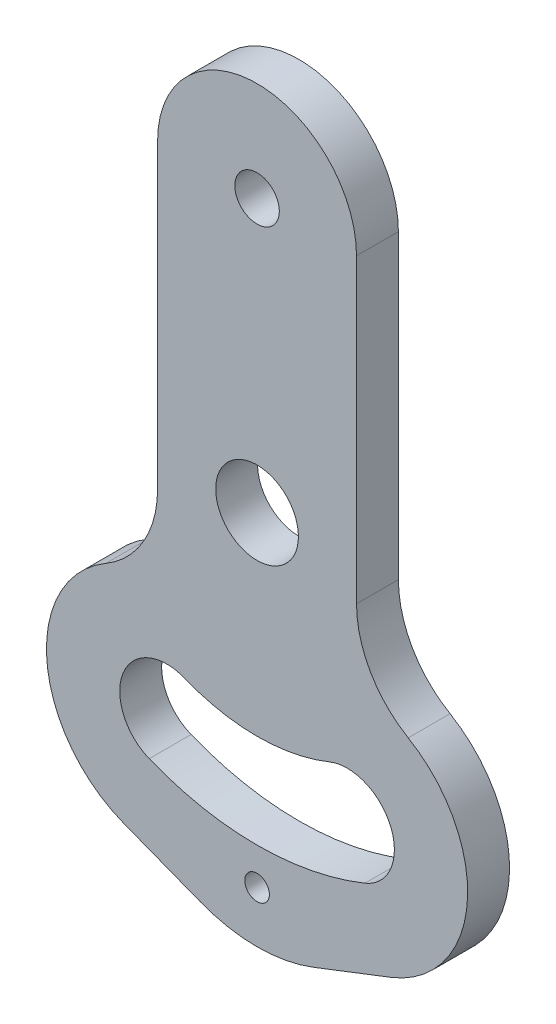
ISO-10303-21;
HEADER;
FILE_DESCRIPTION(('STEP AP214'),'2;1');
FILE_NAME('part.step','',(''),(''),'','','');
FILE_SCHEMA(('AUTOMOTIVE_DESIGN { 1 0 10303 214 1 1 1 1 }'));
ENDSEC;
DATA;
#1=APPLICATION_CONTEXT('core data for automotive mechanical design processes');
#2=APPLICATION_PROTOCOL_DEFINITION('international standard','automotive_design',2000,#1);
#3=PRODUCT_CONTEXT('',#1,'mechanical');
#4=PRODUCT('Part','Part','',(#3));
#5=PRODUCT_RELATED_PRODUCT_CATEGORY('part','',(#4));
#6=PRODUCT_DEFINITION_FORMATION('','',#4);
#7=PRODUCT_DEFINITION_CONTEXT('part definition',#1,'design');
#8=PRODUCT_DEFINITION('design','',#6,#7);
#9=PRODUCT_DEFINITION_SHAPE('','',#8);
#10=(LENGTH_UNIT() NAMED_UNIT(*) SI_UNIT(.MILLI.,.METRE.));
#11=(NAMED_UNIT(*) PLANE_ANGLE_UNIT() SI_UNIT($,.RADIAN.));
#12=(NAMED_UNIT(*) SI_UNIT($,.STERADIAN.) SOLID_ANGLE_UNIT());
#13=UNCERTAINTY_MEASURE_WITH_UNIT(LENGTH_MEASURE(1.E-05),#10,'distance_accuracy_value','');
#14=(GEOMETRIC_REPRESENTATION_CONTEXT(3) GLOBAL_UNCERTAINTY_ASSIGNED_CONTEXT((#13)) GLOBAL_UNIT_ASSIGNED_CONTEXT((#10,
#11,#12)) REPRESENTATION_CONTEXT('',''));
#15=CARTESIAN_POINT('',(0.,0.,0.));
#16=DIRECTION('',(0.,0.,1.));
#17=DIRECTION('',(1.,0.,0.));
#18=AXIS2_PLACEMENT_3D('',#15,#16,#17);
#19=CARTESIAN_POINT('',(-17.2319032971318,19.3495426899277,8.));
#20=DIRECTION('',(0.,0.,1.));
#21=DIRECTION('',(1.,0.,0.));
#22=AXIS2_PLACEMENT_3D('',#19,#20,#21);
#23=PLANE('',#22);
#24=CARTESIAN_POINT('',(0.,114.,8.));
#25=DIRECTION('',(0.,0.,1.));
#26=DIRECTION('',(1.,0.,0.));
#27=AXIS2_PLACEMENT_3D('',#24,#25,#26);
#28=CIRCLE('',#27,4.25);
#29=CARTESIAN_POINT('',(4.25,114.,8.));
#30=VERTEX_POINT('',#29);
#31=EDGE_CURVE('E190',#30,#30,#28,.T.);
#32=ORIENTED_EDGE('',*,*,#31,.F.);
#33=EDGE_LOOP('',(#32));
#34=FACE_BOUND('',#33,.T.);
#35=DIRECTION('',(0.932370708039896,-0.361503613798234,0.));
#36=VECTOR('',#35,1.);
#37=CARTESIAN_POINT('',(-25.5464864144912,-2.09498359498987,8.));
#38=LINE('',#37,#36);
#39=CARTESIAN_POINT('',(-25.5464864144912,-2.09498359498987,8.));
#40=VERTEX_POINT('',#39);
#41=CARTESIAN_POINT('',(-10.845108413947,-7.79507823458163,8.));
#42=VERTEX_POINT('',#41);
#43=EDGE_CURVE('E219',#40,#42,#38,.T.);
#44=ORIENTED_EDGE('',*,*,#43,.T.);
#45=CARTESIAN_POINT('',(0.,20.1760430066152,8.));
#46=DIRECTION('',(0.,0.,1.));
#47=DIRECTION('',(1.,0.,0.));
#48=AXIS2_PLACEMENT_3D('',#45,#46,#47);
#49=CIRCLE('',#48,30.);
#50=CARTESIAN_POINT('',(10.8451084139471,-7.79507823458163,8.));
#51=VERTEX_POINT('',#50);
#52=EDGE_CURVE('E11',#42,#51,#49,.T.);
#53=ORIENTED_EDGE('',*,*,#52,.T.);
#54=DIRECTION('',(0.932370708039896,0.361503613798235,0.));
#55=VECTOR('',#54,1.);
#56=CARTESIAN_POINT('',(25.5464864144913,-2.09498359498986,8.));
#57=LINE('',#56,#55);
#58=CARTESIAN_POINT('',(25.5464864144913,-2.09498359498986,8.));
#59=VERTEX_POINT('',#58);
#60=EDGE_CURVE('E202',#51,#59,#57,.T.);
#61=ORIENTED_EDGE('',*,*,#60,.T.);
#62=CARTESIAN_POINT('',(17.2319032971319,19.3495426899277,8.));
#63=DIRECTION('',(0.,0.,1.));
#64=DIRECTION('',(-1.,0.,0.));
#65=AXIS2_PLACEMENT_3D('',#62,#63,#64);
#66=CIRCLE('',#65,23.);
#67=CARTESIAN_POINT('',(28.8753038591311,39.1846434800129,8.));
#68=VERTEX_POINT('',#67);
#69=EDGE_CURVE('E204',#59,#68,#66,.T.);
#70=ORIENTED_EDGE('',*,*,#69,.T.);
#71=CARTESIAN_POINT('',(39.,56.4325572105217,8.));
#72=DIRECTION('',(0.,0.,-1.));
#73=DIRECTION('',(-1.,0.,0.));
#74=AXIS2_PLACEMENT_3D('',#71,#72,#73);
#75=CIRCLE('',#74,20.);
#76=CARTESIAN_POINT('',(19.,56.4325572105217,8.));
#77=VERTEX_POINT('',#76);
#78=EDGE_CURVE('E207',#68,#77,#75,.T.);
#79=ORIENTED_EDGE('',*,*,#78,.T.);
#80=DIRECTION('',(0.,1.,0.));
#81=VECTOR('',#80,1.);
#82=CARTESIAN_POINT('',(19.,114.,8.));
#83=LINE('',#82,#81);
#84=CARTESIAN_POINT('',(19.,114.,8.));
#85=VERTEX_POINT('',#84);
#86=EDGE_CURVE('E209',#77,#85,#83,.T.);
#87=ORIENTED_EDGE('',*,*,#86,.T.);
#88=CARTESIAN_POINT('',(0.,114.,8.));
#89=DIRECTION('',(0.,0.,1.));
#90=DIRECTION('',(-1.,0.,0.));
#91=AXIS2_PLACEMENT_3D('',#88,#89,#90);
#92=CIRCLE('',#91,19.);
#93=CARTESIAN_POINT('',(-19.,114.,8.));
#94=VERTEX_POINT('',#93);
#95=EDGE_CURVE('E211',#85,#94,#92,.T.);
#96=ORIENTED_EDGE('',*,*,#95,.T.);
#97=DIRECTION('',(0.,-1.,0.));
#98=VECTOR('',#97,1.);
#99=CARTESIAN_POINT('',(-19.,114.,8.));
#100=LINE('',#99,#98);
#101=CARTESIAN_POINT('',(-19.,56.4325572105217,8.));
#102=VERTEX_POINT('',#101);
#103=EDGE_CURVE('E213',#94,#102,#100,.T.);
#104=ORIENTED_EDGE('',*,*,#103,.T.);
#105=CARTESIAN_POINT('',(-39.,56.4325572105217,8.));
#106=DIRECTION('',(0.,0.,-1.));
#107=DIRECTION('',(-1.,0.,0.));
#108=AXIS2_PLACEMENT_3D('',#105,#106,#107);
#109=CIRCLE('',#108,20.);
#110=CARTESIAN_POINT('',(-28.8753038591311,39.1846434800129,8.));
#111=VERTEX_POINT('',#110);
#112=EDGE_CURVE('E215',#102,#111,#109,.T.);
#113=ORIENTED_EDGE('',*,*,#112,.T.);
#114=CARTESIAN_POINT('',(-17.2319032971318,19.3495426899277,8.));
#115=DIRECTION('',(0.,0.,1.));
#116=DIRECTION('',(1.,0.,0.));
#117=AXIS2_PLACEMENT_3D('',#114,#115,#116);
#118=CIRCLE('',#117,23.);
#119=EDGE_CURVE('E217',#111,#40,#118,.T.);
#120=ORIENTED_EDGE('',*,*,#119,.T.);
#121=EDGE_LOOP('',(#44,#53,#61,#70,#79,#87,#96,#104,#113,#120));
#122=FACE_BOUND('',#121,.T.);
#123=CARTESIAN_POINT('',(0.,62.,8.));
#124=DIRECTION('',(0.,0.,1.));
#125=DIRECTION('',(1.,0.,0.));
#126=AXIS2_PLACEMENT_3D('',#123,#124,#125);
#127=CIRCLE('',#126,7.9);
#128=CARTESIAN_POINT('',(7.90000000000001,62.,8.));
#129=VERTEX_POINT('',#128);
#130=EDGE_CURVE('E196',#129,#129,#127,.T.);
#131=ORIENTED_EDGE('',*,*,#130,.F.);
#132=EDGE_LOOP('',(#131));
#133=FACE_BOUND('',#132,.T.);
#134=CARTESIAN_POINT('',(0.,0.,8.));
#135=DIRECTION('',(0.,0.,1.));
#136=DIRECTION('',(1.,0.,0.));
#137=AXIS2_PLACEMENT_3D('',#134,#135,#136);
#138=CIRCLE('',#137,2.35);
#139=CARTESIAN_POINT('',(2.35,0.,8.));
#140=VERTEX_POINT('',#139);
#141=EDGE_CURVE('E184',#140,#140,#138,.T.);
#142=ORIENTED_EDGE('',*,*,#141,.F.);
#143=EDGE_LOOP('',(#142));
#144=FACE_BOUND('',#143,.T.);
#145=CARTESIAN_POINT('',(0.,62.,8.));
#146=DIRECTION('',(0.,0.,1.));
#147=DIRECTION('',(1.,0.,0.));
#148=AXIS2_PLACEMENT_3D('',#145,#146,#147);
#149=CIRCLE('',#148,55.);
#150=CARTESIAN_POINT('',(-20.603362637875,11.0048879988267,8.));
#151=VERTEX_POINT('',#150);
#152=CARTESIAN_POINT('',(20.603362637875,11.0048879988266,8.));
#153=VERTEX_POINT('',#152);
#154=EDGE_CURVE('E153',#151,#153,#149,.T.);
#155=ORIENTED_EDGE('',*,*,#154,.F.);
#156=CARTESIAN_POINT('',(-17.2319032971318,19.3495426899277,8.));
#157=DIRECTION('',(0.,0.,1.));
#158=DIRECTION('',(1.,0.,0.));
#159=AXIS2_PLACEMENT_3D('',#156,#157,#158);
#160=CIRCLE('',#159,9.);
#161=CARTESIAN_POINT('',(-13.8604439563887,27.6941973810288,8.));
#162=VERTEX_POINT('',#161);
#163=EDGE_CURVE('E143',#162,#151,#160,.T.);
#164=ORIENTED_EDGE('',*,*,#163,.F.);
#165=CARTESIAN_POINT('',(0.,62.,8.));
#166=DIRECTION('',(0.,0.,-1.));
#167=DIRECTION('',(1.,0.,0.));
#168=AXIS2_PLACEMENT_3D('',#165,#166,#167);
#169=CIRCLE('',#168,37.);
#170=CARTESIAN_POINT('',(13.8604439563887,27.6941973810288,8.));
#171=VERTEX_POINT('',#170);
#172=EDGE_CURVE('E168',#171,#162,#169,.T.);
#173=ORIENTED_EDGE('',*,*,#172,.F.);
#174=CARTESIAN_POINT('',(17.2319032971319,19.3495426899277,8.));
#175=DIRECTION('',(0.,0.,1.));
#176=DIRECTION('',(1.,0.,0.));
#177=AXIS2_PLACEMENT_3D('',#174,#175,#176);
#178=CIRCLE('',#177,9.);
#179=EDGE_CURVE('E166',#153,#171,#178,.T.);
#180=ORIENTED_EDGE('',*,*,#179,.F.);
#181=EDGE_LOOP('',(#155,#164,#173,#180));
#182=FACE_BOUND('',#181,.T.);
#183=ADVANCED_FACE('F41',(#34,#122,#133,#144,#182),#23,.T.);
#184=CARTESIAN_POINT('',(-17.2319032971318,19.3495426899277,0.));
#185=DIRECTION('',(0.,0.,1.));
#186=DIRECTION('',(1.,0.,0.));
#187=AXIS2_PLACEMENT_3D('',#184,#185,#186);
#188=PLANE('',#187);
#189=CARTESIAN_POINT('',(0.,0.,0.));
#190=DIRECTION('',(0.,0.,1.));
#191=DIRECTION('',(1.,0.,0.));
#192=AXIS2_PLACEMENT_3D('',#189,#190,#191);
#193=CIRCLE('',#192,2.35);
#194=CARTESIAN_POINT('',(2.35,0.,0.));
#195=VERTEX_POINT('',#194);
#196=EDGE_CURVE('E161',#195,#195,#193,.T.);
#197=ORIENTED_EDGE('',*,*,#196,.T.);
#198=EDGE_LOOP('',(#197));
#199=FACE_BOUND('',#198,.T.);
#200=CARTESIAN_POINT('',(0.,114.,0.));
#201=DIRECTION('',(0.,0.,1.));
#202=DIRECTION('',(1.,0.,0.));
#203=AXIS2_PLACEMENT_3D('',#200,#201,#202);
#204=CIRCLE('',#203,4.25);
#205=CARTESIAN_POINT('',(4.25,114.,0.));
#206=VERTEX_POINT('',#205);
#207=EDGE_CURVE('E187',#206,#206,#204,.T.);
#208=ORIENTED_EDGE('',*,*,#207,.T.);
#209=EDGE_LOOP('',(#208));
#210=FACE_BOUND('',#209,.T.);
#211=CARTESIAN_POINT('',(0.,62.,0.));
#212=DIRECTION('',(0.,0.,1.));
#213=DIRECTION('',(1.,0.,0.));
#214=AXIS2_PLACEMENT_3D('',#211,#212,#213);
#215=CIRCLE('',#214,7.9);
#216=CARTESIAN_POINT('',(7.90000000000001,62.,0.));
#217=VERTEX_POINT('',#216);
#218=EDGE_CURVE('E193',#217,#217,#215,.T.);
#219=ORIENTED_EDGE('',*,*,#218,.T.);
#220=EDGE_LOOP('',(#219));
#221=FACE_BOUND('',#220,.T.);
#222=DIRECTION('',(0.932370708039896,0.361503613798235,0.));
#223=VECTOR('',#222,1.);
#224=CARTESIAN_POINT('',(25.5464864144913,-2.09498359498986,0.));
#225=LINE('',#224,#223);
#226=CARTESIAN_POINT('',(10.8451084139471,-7.79507823458163,0.));
#227=VERTEX_POINT('',#226);
#228=CARTESIAN_POINT('',(25.5464864144913,-2.09498359498986,0.));
#229=VERTEX_POINT('',#228);
#230=EDGE_CURVE('E199',#227,#229,#225,.T.);
#231=ORIENTED_EDGE('',*,*,#230,.F.);
#232=CARTESIAN_POINT('',(0.,20.1760430066152,0.));
#233=DIRECTION('',(0.,0.,1.));
#234=DIRECTION('',(1.,0.,0.));
#235=AXIS2_PLACEMENT_3D('',#232,#233,#234);
#236=CIRCLE('',#235,30.);
#237=CARTESIAN_POINT('',(-10.845108413947,-7.79507823458163,0.));
#238=VERTEX_POINT('',#237);
#239=EDGE_CURVE('E63',#227,#238,#236,.F.);
#240=ORIENTED_EDGE('',*,*,#239,.T.);
#241=DIRECTION('',(0.932370708039896,-0.361503613798234,0.));
#242=VECTOR('',#241,1.);
#243=CARTESIAN_POINT('',(-25.5464864144912,-2.09498359498987,0.));
#244=LINE('',#243,#242);
#245=CARTESIAN_POINT('',(-25.5464864144912,-2.09498359498987,0.));
#246=VERTEX_POINT('',#245);
#247=EDGE_CURVE('E205',#246,#238,#244,.T.);
#248=ORIENTED_EDGE('',*,*,#247,.F.);
#249=CARTESIAN_POINT('',(-17.2319032971318,19.3495426899277,0.));
#250=DIRECTION('',(0.,0.,1.));
#251=DIRECTION('',(1.,0.,0.));
#252=AXIS2_PLACEMENT_3D('',#249,#250,#251);
#253=CIRCLE('',#252,23.);
#254=CARTESIAN_POINT('',(-28.8753038591311,39.1846434800129,0.));
#255=VERTEX_POINT('',#254);
#256=EDGE_CURVE('E235',#255,#246,#253,.T.);
#257=ORIENTED_EDGE('',*,*,#256,.F.);
#258=CARTESIAN_POINT('',(-39.,56.4325572105217,0.));
#259=DIRECTION('',(0.,0.,-1.));
#260=DIRECTION('',(-1.,0.,0.));
#261=AXIS2_PLACEMENT_3D('',#258,#259,#260);
#262=CIRCLE('',#261,20.);
#263=CARTESIAN_POINT('',(-19.,56.4325572105217,0.));
#264=VERTEX_POINT('',#263);
#265=EDGE_CURVE('E233',#264,#255,#262,.T.);
#266=ORIENTED_EDGE('',*,*,#265,.F.);
#267=DIRECTION('',(0.,-1.,0.));
#268=VECTOR('',#267,1.);
#269=CARTESIAN_POINT('',(-19.,114.,0.));
#270=LINE('',#269,#268);
#271=CARTESIAN_POINT('',(-19.,114.,0.));
#272=VERTEX_POINT('',#271);
#273=EDGE_CURVE('E231',#272,#264,#270,.T.);
#274=ORIENTED_EDGE('',*,*,#273,.F.);
#275=CARTESIAN_POINT('',(0.,114.,0.));
#276=DIRECTION('',(0.,0.,1.));
#277=DIRECTION('',(-1.,0.,0.));
#278=AXIS2_PLACEMENT_3D('',#275,#276,#277);
#279=CIRCLE('',#278,19.);
#280=CARTESIAN_POINT('',(19.,114.,0.));
#281=VERTEX_POINT('',#280);
#282=EDGE_CURVE('E229',#281,#272,#279,.T.);
#283=ORIENTED_EDGE('',*,*,#282,.F.);
#284=DIRECTION('',(0.,1.,0.));
#285=VECTOR('',#284,1.);
#286=CARTESIAN_POINT('',(19.,114.,0.));
#287=LINE('',#286,#285);
#288=CARTESIAN_POINT('',(19.,56.4325572105217,0.));
#289=VERTEX_POINT('',#288);
#290=EDGE_CURVE('E227',#289,#281,#287,.T.);
#291=ORIENTED_EDGE('',*,*,#290,.F.);
#292=CARTESIAN_POINT('',(39.,56.4325572105217,0.));
#293=DIRECTION('',(0.,0.,-1.));
#294=DIRECTION('',(-1.,0.,0.));
#295=AXIS2_PLACEMENT_3D('',#292,#293,#294);
#296=CIRCLE('',#295,20.);
#297=CARTESIAN_POINT('',(28.8753038591311,39.1846434800129,0.));
#298=VERTEX_POINT('',#297);
#299=EDGE_CURVE('E225',#298,#289,#296,.T.);
#300=ORIENTED_EDGE('',*,*,#299,.F.);
#301=CARTESIAN_POINT('',(17.2319032971319,19.3495426899277,0.));
#302=DIRECTION('',(0.,0.,1.));
#303=DIRECTION('',(-1.,0.,0.));
#304=AXIS2_PLACEMENT_3D('',#301,#302,#303);
#305=CIRCLE('',#304,23.);
#306=EDGE_CURVE('E223',#229,#298,#305,.T.);
#307=ORIENTED_EDGE('',*,*,#306,.F.);
#308=EDGE_LOOP('',(#231,#240,#248,#257,#266,#274,#283,#291,#300,#307));
#309=FACE_BOUND('',#308,.T.);
#310=CARTESIAN_POINT('',(-17.2319032971318,19.3495426899277,0.));
#311=DIRECTION('',(0.,0.,1.));
#312=DIRECTION('',(1.,0.,0.));
#313=AXIS2_PLACEMENT_3D('',#310,#311,#312);
#314=CIRCLE('',#313,9.);
#315=CARTESIAN_POINT('',(-13.8604439563887,27.6941973810288,0.));
#316=VERTEX_POINT('',#315);
#317=CARTESIAN_POINT('',(-20.603362637875,11.0048879988267,0.));
#318=VERTEX_POINT('',#317);
#319=EDGE_CURVE('E172',#316,#318,#314,.T.);
#320=ORIENTED_EDGE('',*,*,#319,.T.);
#321=CARTESIAN_POINT('',(0.,62.,0.));
#322=DIRECTION('',(0.,0.,1.));
#323=DIRECTION('',(1.,0.,0.));
#324=AXIS2_PLACEMENT_3D('',#321,#322,#323);
#325=CIRCLE('',#324,55.);
#326=CARTESIAN_POINT('',(20.603362637875,11.0048879988266,0.));
#327=VERTEX_POINT('',#326);
#328=EDGE_CURVE('E160',#318,#327,#325,.T.);
#329=ORIENTED_EDGE('',*,*,#328,.T.);
#330=CARTESIAN_POINT('',(17.2319032971319,19.3495426899277,0.));
#331=DIRECTION('',(0.,0.,1.));
#332=DIRECTION('',(1.,0.,0.));
#333=AXIS2_PLACEMENT_3D('',#330,#331,#332);
#334=CIRCLE('',#333,9.);
#335=CARTESIAN_POINT('',(13.8604439563887,27.6941973810288,0.));
#336=VERTEX_POINT('',#335);
#337=EDGE_CURVE('E175',#327,#336,#334,.T.);
#338=ORIENTED_EDGE('',*,*,#337,.T.);
#339=CARTESIAN_POINT('',(0.,62.,0.));
#340=DIRECTION('',(0.,0.,-1.));
#341=DIRECTION('',(1.,0.,0.));
#342=AXIS2_PLACEMENT_3D('',#339,#340,#341);
#343=CIRCLE('',#342,37.);
#344=EDGE_CURVE('E154',#336,#316,#343,.T.);
#345=ORIENTED_EDGE('',*,*,#344,.T.);
#346=EDGE_LOOP('',(#320,#329,#338,#345));
#347=FACE_BOUND('',#346,.T.);
#348=ADVANCED_FACE('F272',(#199,#210,#221,#309,#347),#188,.F.);
#349=CARTESIAN_POINT('',(25.5464864144913,-2.09498359498986,8.));
#350=DIRECTION('',(-0.361503613798235,0.932370708039896,0.));
#351=DIRECTION('',(-0.932370708039896,-0.361503613798235,0.));
#352=AXIS2_PLACEMENT_3D('',#349,#350,#351);
#353=PLANE('',#352);
#354=ORIENTED_EDGE('',*,*,#60,.F.);
#355=DIRECTION('',(0.,0.,-1.));
#356=VECTOR('',#355,1.);
#357=CARTESIAN_POINT('',(10.8451084139471,-7.79507823458163,8.));
#358=LINE('',#357,#356);
#359=EDGE_CURVE('E261',#51,#227,#358,.T.);
#360=ORIENTED_EDGE('',*,*,#359,.T.);
#361=ORIENTED_EDGE('',*,*,#230,.T.);
#362=DIRECTION('',(0.,0.,-1.));
#363=VECTOR('',#362,1.);
#364=CARTESIAN_POINT('',(25.5464864144913,-2.09498359498986,8.));
#365=LINE('',#364,#363);
#366=EDGE_CURVE('E258',#59,#229,#365,.T.);
#367=ORIENTED_EDGE('',*,*,#366,.F.);
#368=EDGE_LOOP('',(#354,#360,#361,#367));
#369=FACE_BOUND('',#368,.T.);
#370=ADVANCED_FACE('F267',(#369),#353,.F.);
#371=CARTESIAN_POINT('',(17.2319032971319,19.3495426899277,8.));
#372=DIRECTION('',(0.,0.,-1.));
#373=DIRECTION('',(-1.,0.,0.));
#374=AXIS2_PLACEMENT_3D('',#371,#372,#373);
#375=CYLINDRICAL_SURFACE('',#374,23.);
#376=ORIENTED_EDGE('',*,*,#306,.T.);
#377=DIRECTION('',(0.,0.,-1.));
#378=VECTOR('',#377,1.);
#379=CARTESIAN_POINT('',(28.8753038591311,39.1846434800129,8.));
#380=LINE('',#379,#378);
#381=EDGE_CURVE('E255',#68,#298,#380,.T.);
#382=ORIENTED_EDGE('',*,*,#381,.F.);
#383=ORIENTED_EDGE('',*,*,#69,.F.);
#384=ORIENTED_EDGE('',*,*,#366,.T.);
#385=EDGE_LOOP('',(#376,#382,#383,#384));
#386=FACE_BOUND('',#385,.T.);
#387=ADVANCED_FACE('F279',(#386),#375,.T.);
#388=CARTESIAN_POINT('',(39.,56.4325572105217,8.));
#389=DIRECTION('',(0.,0.,-1.));
#390=DIRECTION('',(-1.,0.,0.));
#391=AXIS2_PLACEMENT_3D('',#388,#389,#390);
#392=CYLINDRICAL_SURFACE('',#391,20.);
#393=ORIENTED_EDGE('',*,*,#299,.T.);
#394=DIRECTION('',(0.,0.,-1.));
#395=VECTOR('',#394,1.);
#396=CARTESIAN_POINT('',(19.,56.4325572105217,8.));
#397=LINE('',#396,#395);
#398=EDGE_CURVE('E252',#77,#289,#397,.T.);
#399=ORIENTED_EDGE('',*,*,#398,.F.);
#400=ORIENTED_EDGE('',*,*,#78,.F.);
#401=ORIENTED_EDGE('',*,*,#381,.T.);
#402=EDGE_LOOP('',(#393,#399,#400,#401));
#403=FACE_BOUND('',#402,.T.);
#404=ADVANCED_FACE('F327',(#403),#392,.F.);
#405=CARTESIAN_POINT('',(19.,114.,8.));
#406=DIRECTION('',(-1.,0.,0.));
#407=DIRECTION('',(0.,-1.,0.));
#408=AXIS2_PLACEMENT_3D('',#405,#406,#407);
#409=PLANE('',#408);
#410=ORIENTED_EDGE('',*,*,#290,.T.);
#411=DIRECTION('',(0.,0.,-1.));
#412=VECTOR('',#411,1.);
#413=CARTESIAN_POINT('',(19.,114.,8.));
#414=LINE('',#413,#412);
#415=EDGE_CURVE('E249',#85,#281,#414,.T.);
#416=ORIENTED_EDGE('',*,*,#415,.F.);
#417=ORIENTED_EDGE('',*,*,#86,.F.);
#418=ORIENTED_EDGE('',*,*,#398,.T.);
#419=EDGE_LOOP('',(#410,#416,#417,#418));
#420=FACE_BOUND('',#419,.T.);
#421=ADVANCED_FACE('F323',(#420),#409,.F.);
#422=CARTESIAN_POINT('',(0.,114.,8.));
#423=DIRECTION('',(0.,0.,-1.));
#424=DIRECTION('',(-1.,0.,0.));
#425=AXIS2_PLACEMENT_3D('',#422,#423,#424);
#426=CYLINDRICAL_SURFACE('',#425,19.);
#427=ORIENTED_EDGE('',*,*,#282,.T.);
#428=DIRECTION('',(0.,0.,-1.));
#429=VECTOR('',#428,1.);
#430=CARTESIAN_POINT('',(-19.,114.,8.));
#431=LINE('',#430,#429);
#432=EDGE_CURVE('E246',#94,#272,#431,.T.);
#433=ORIENTED_EDGE('',*,*,#432,.F.);
#434=ORIENTED_EDGE('',*,*,#95,.F.);
#435=ORIENTED_EDGE('',*,*,#415,.T.);
#436=EDGE_LOOP('',(#427,#433,#434,#435));
#437=FACE_BOUND('',#436,.T.);
#438=ADVANCED_FACE('F319',(#437),#426,.T.);
#439=CARTESIAN_POINT('',(-19.,114.,8.));
#440=DIRECTION('',(1.,0.,0.));
#441=DIRECTION('',(0.,0.,-1.));
#442=AXIS2_PLACEMENT_3D('',#439,#440,#441);
#443=PLANE('',#442);
#444=ORIENTED_EDGE('',*,*,#273,.T.);
#445=DIRECTION('',(0.,0.,-1.));
#446=VECTOR('',#445,1.);
#447=CARTESIAN_POINT('',(-19.,56.4325572105217,8.));
#448=LINE('',#447,#446);
#449=EDGE_CURVE('E243',#102,#264,#448,.T.);
#450=ORIENTED_EDGE('',*,*,#449,.F.);
#451=ORIENTED_EDGE('',*,*,#103,.F.);
#452=ORIENTED_EDGE('',*,*,#432,.T.);
#453=EDGE_LOOP('',(#444,#450,#451,#452));
#454=FACE_BOUND('',#453,.T.);
#455=ADVANCED_FACE('F315',(#454),#443,.F.);
#456=CARTESIAN_POINT('',(-39.,56.4325572105217,8.));
#457=DIRECTION('',(0.,0.,-1.));
#458=DIRECTION('',(-1.,0.,0.));
#459=AXIS2_PLACEMENT_3D('',#456,#457,#458);
#460=CYLINDRICAL_SURFACE('',#459,20.);
#461=ORIENTED_EDGE('',*,*,#265,.T.);
#462=DIRECTION('',(0.,0.,-1.));
#463=VECTOR('',#462,1.);
#464=CARTESIAN_POINT('',(-28.8753038591311,39.1846434800129,8.));
#465=LINE('',#464,#463);
#466=EDGE_CURVE('E240',#111,#255,#465,.T.);
#467=ORIENTED_EDGE('',*,*,#466,.F.);
#468=ORIENTED_EDGE('',*,*,#112,.F.);
#469=ORIENTED_EDGE('',*,*,#449,.T.);
#470=EDGE_LOOP('',(#461,#467,#468,#469));
#471=FACE_BOUND('',#470,.T.);
#472=ADVANCED_FACE('F311',(#471),#460,.F.);
#473=CARTESIAN_POINT('',(-17.2319032971318,19.3495426899277,8.));
#474=DIRECTION('',(0.,0.,-1.));
#475=DIRECTION('',(-1.,0.,0.));
#476=AXIS2_PLACEMENT_3D('',#473,#474,#475);
#477=CYLINDRICAL_SURFACE('',#476,23.);
#478=ORIENTED_EDGE('',*,*,#256,.T.);
#479=DIRECTION('',(0.,0.,-1.));
#480=VECTOR('',#479,1.);
#481=CARTESIAN_POINT('',(-25.5464864144912,-2.09498359498987,8.));
#482=LINE('',#481,#480);
#483=EDGE_CURVE('E221',#40,#246,#482,.T.);
#484=ORIENTED_EDGE('',*,*,#483,.F.);
#485=ORIENTED_EDGE('',*,*,#119,.F.);
#486=ORIENTED_EDGE('',*,*,#466,.T.);
#487=EDGE_LOOP('',(#478,#484,#485,#486));
#488=FACE_BOUND('',#487,.T.);
#489=ADVANCED_FACE('F308',(#488),#477,.T.);
#490=CARTESIAN_POINT('',(-25.5464864144912,-2.09498359498987,8.));
#491=DIRECTION('',(0.361503613798234,0.932370708039896,0.));
#492=DIRECTION('',(-0.932370708039896,0.361503613798234,0.));
#493=AXIS2_PLACEMENT_3D('',#490,#491,#492);
#494=PLANE('',#493);
#495=ORIENTED_EDGE('',*,*,#247,.T.);
#496=DIRECTION('',(0.,0.,-1.));
#497=VECTOR('',#496,1.);
#498=CARTESIAN_POINT('',(-10.845108413947,-7.79507823458164,8.));
#499=LINE('',#498,#497);
#500=EDGE_CURVE('E49',#238,#42,#499,.F.);
#501=ORIENTED_EDGE('',*,*,#500,.T.);
#502=ORIENTED_EDGE('',*,*,#43,.F.);
#503=ORIENTED_EDGE('',*,*,#483,.T.);
#504=EDGE_LOOP('',(#495,#501,#502,#503));
#505=FACE_BOUND('',#504,.T.);
#506=ADVANCED_FACE('F305',(#505),#494,.F.);
#507=CARTESIAN_POINT('',(0.,62.,8.));
#508=DIRECTION('',(0.,0.,-1.));
#509=DIRECTION('',(-1.,0.,0.));
#510=AXIS2_PLACEMENT_3D('',#507,#508,#509);
#511=CYLINDRICAL_SURFACE('',#510,7.9);
#512=ORIENTED_EDGE('',*,*,#130,.T.);
#513=EDGE_LOOP('',(#512));
#514=FACE_BOUND('',#513,.T.);
#515=ORIENTED_EDGE('',*,*,#218,.F.);
#516=EDGE_LOOP('',(#515));
#517=FACE_BOUND('',#516,.T.);
#518=ADVANCED_FACE('F302',(#514,#517),#511,.F.);
#519=CARTESIAN_POINT('',(0.,114.,8.));
#520=DIRECTION('',(0.,0.,-1.));
#521=DIRECTION('',(-1.,0.,0.));
#522=AXIS2_PLACEMENT_3D('',#519,#520,#521);
#523=CYLINDRICAL_SURFACE('',#522,4.25);
#524=ORIENTED_EDGE('',*,*,#31,.T.);
#525=EDGE_LOOP('',(#524));
#526=FACE_BOUND('',#525,.T.);
#527=ORIENTED_EDGE('',*,*,#207,.F.);
#528=EDGE_LOOP('',(#527));
#529=FACE_BOUND('',#528,.T.);
#530=ADVANCED_FACE('F376',(#526,#529),#523,.F.);
#531=CARTESIAN_POINT('',(0.,0.,8.));
#532=DIRECTION('',(0.,0.,-1.));
#533=DIRECTION('',(-1.,0.,0.));
#534=AXIS2_PLACEMENT_3D('',#531,#532,#533);
#535=CYLINDRICAL_SURFACE('',#534,2.35);
#536=ORIENTED_EDGE('',*,*,#141,.T.);
#537=EDGE_LOOP('',(#536));
#538=FACE_BOUND('',#537,.T.);
#539=ORIENTED_EDGE('',*,*,#196,.F.);
#540=EDGE_LOOP('',(#539));
#541=FACE_BOUND('',#540,.T.);
#542=ADVANCED_FACE('F383',(#538,#541),#535,.F.);
#543=CARTESIAN_POINT('',(-17.2319032971318,19.3495426899277,8.));
#544=DIRECTION('',(0.,0.,-1.));
#545=DIRECTION('',(-1.,0.,0.));
#546=AXIS2_PLACEMENT_3D('',#543,#544,#545);
#547=CYLINDRICAL_SURFACE('',#546,9.);
#548=ORIENTED_EDGE('',*,*,#319,.F.);
#549=DIRECTION('',(0.,0.,-1.));
#550=VECTOR('',#549,1.);
#551=CARTESIAN_POINT('',(-13.8604439563887,27.6941973810288,8.));
#552=LINE('',#551,#550);
#553=EDGE_CURVE('E149',#162,#316,#552,.T.);
#554=ORIENTED_EDGE('',*,*,#553,.F.);
#555=ORIENTED_EDGE('',*,*,#163,.T.);
#556=DIRECTION('',(0.,0.,-1.));
#557=VECTOR('',#556,1.);
#558=CARTESIAN_POINT('',(-20.603362637875,11.0048879988267,8.));
#559=LINE('',#558,#557);
#560=EDGE_CURVE('E146',#151,#318,#559,.T.);
#561=ORIENTED_EDGE('',*,*,#560,.T.);
#562=EDGE_LOOP('',(#548,#554,#555,#561));
#563=FACE_BOUND('',#562,.T.);
#564=ADVANCED_FACE('F145',(#563),#547,.F.);
#565=CARTESIAN_POINT('',(0.,62.,8.));
#566=DIRECTION('',(0.,0.,-1.));
#567=DIRECTION('',(-1.,0.,0.));
#568=AXIS2_PLACEMENT_3D('',#565,#566,#567);
#569=CYLINDRICAL_SURFACE('',#568,55.);
#570=ORIENTED_EDGE('',*,*,#328,.F.);
#571=ORIENTED_EDGE('',*,*,#560,.F.);
#572=ORIENTED_EDGE('',*,*,#154,.T.);
#573=DIRECTION('',(0.,0.,-1.));
#574=VECTOR('',#573,1.);
#575=CARTESIAN_POINT('',(20.603362637875,11.0048879988266,8.));
#576=LINE('',#575,#574);
#577=EDGE_CURVE('E162',#153,#327,#576,.T.);
#578=ORIENTED_EDGE('',*,*,#577,.T.);
#579=EDGE_LOOP('',(#570,#571,#572,#578));
#580=FACE_BOUND('',#579,.T.);
#581=ADVANCED_FACE('F157',(#580),#569,.F.);
#582=CARTESIAN_POINT('',(17.2319032971319,19.3495426899277,8.));
#583=DIRECTION('',(0.,0.,-1.));
#584=DIRECTION('',(-1.,0.,0.));
#585=AXIS2_PLACEMENT_3D('',#582,#583,#584);
#586=CYLINDRICAL_SURFACE('',#585,9.);
#587=ORIENTED_EDGE('',*,*,#337,.F.);
#588=ORIENTED_EDGE('',*,*,#577,.F.);
#589=ORIENTED_EDGE('',*,*,#179,.T.);
#590=DIRECTION('',(0.,0.,-1.));
#591=VECTOR('',#590,1.);
#592=CARTESIAN_POINT('',(13.8604439563887,27.6941973810288,8.));
#593=LINE('',#592,#591);
#594=EDGE_CURVE('E181',#171,#336,#593,.T.);
#595=ORIENTED_EDGE('',*,*,#594,.T.);
#596=EDGE_LOOP('',(#587,#588,#589,#595));
#597=FACE_BOUND('',#596,.T.);
#598=ADVANCED_FACE('F289',(#597),#586,.F.);
#599=CARTESIAN_POINT('',(0.,62.,8.));
#600=DIRECTION('',(0.,0.,-1.));
#601=DIRECTION('',(-1.,0.,0.));
#602=AXIS2_PLACEMENT_3D('',#599,#600,#601);
#603=CYLINDRICAL_SURFACE('',#602,37.);
#604=ORIENTED_EDGE('',*,*,#344,.F.);
#605=ORIENTED_EDGE('',*,*,#594,.F.);
#606=ORIENTED_EDGE('',*,*,#172,.T.);
#607=ORIENTED_EDGE('',*,*,#553,.T.);
#608=EDGE_LOOP('',(#604,#605,#606,#607));
#609=FACE_BOUND('',#608,.T.);
#610=ADVANCED_FACE('F285',(#609),#603,.T.);
#611=CARTESIAN_POINT('',(0.,20.1760430066152,8.));
#612=DIRECTION('',(0.,0.,-1.));
#613=DIRECTION('',(-1.,0.,0.));
#614=AXIS2_PLACEMENT_3D('',#611,#612,#613);
#615=CYLINDRICAL_SURFACE('',#614,30.);
#616=ORIENTED_EDGE('',*,*,#52,.F.);
#617=ORIENTED_EDGE('',*,*,#500,.F.);
#618=ORIENTED_EDGE('',*,*,#239,.F.);
#619=ORIENTED_EDGE('',*,*,#359,.F.);
#620=EDGE_LOOP('',(#616,#617,#618,#619));
#621=FACE_BOUND('',#620,.T.);
#622=ADVANCED_FACE('F43',(#621),#615,.T.);
#623=CLOSED_SHELL('',(#183,#348,#370,#387,#404,#421,#438,#455,#472,#489,#506,#518,#530,#542,
#564,#581,#598,#610,#622));
#624=MANIFOLD_SOLID_BREP('B2',#623);
#625=ADVANCED_BREP_SHAPE_REPRESENTATION('',(#18,#624),#14);
#626=SHAPE_DEFINITION_REPRESENTATION(#9,#625);
ENDSEC;
END-ISO-10303-21;
